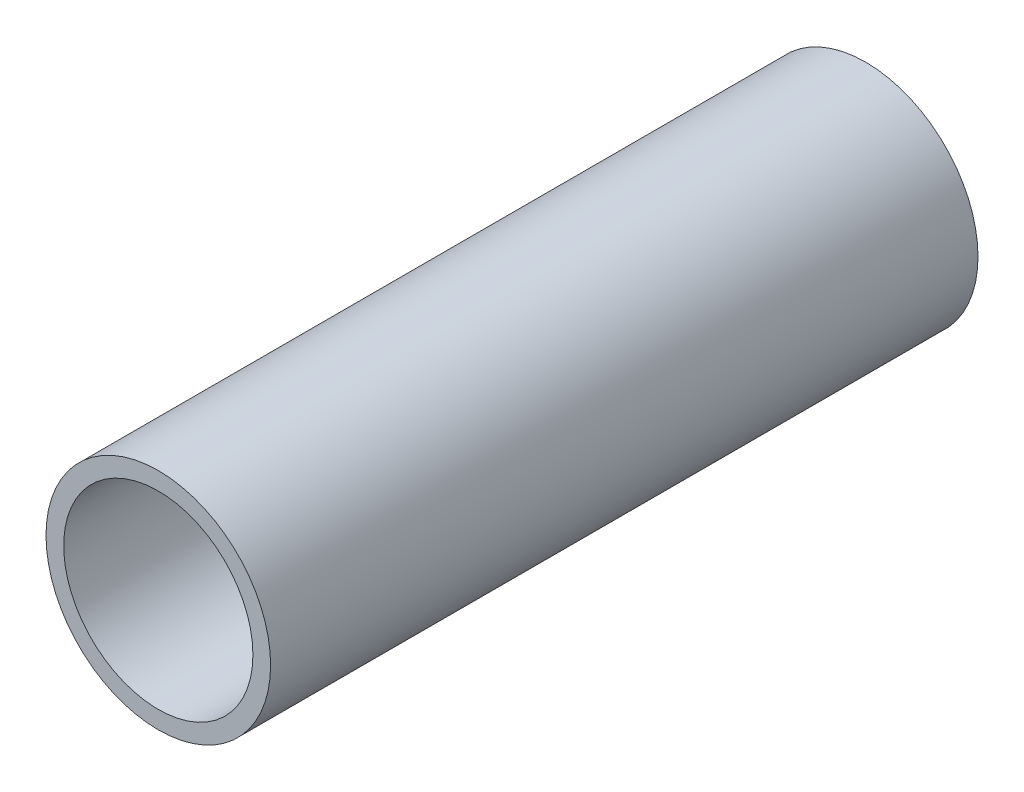
ISO-10303-21;
HEADER;
FILE_DESCRIPTION(('STEP AP214'),'2;1');
FILE_NAME('part.step','',(''),(''),'','','');
FILE_SCHEMA(('AUTOMOTIVE_DESIGN { 1 0 10303 214 1 1 1 1 }'));
ENDSEC;
DATA;
#1=APPLICATION_CONTEXT('core data for automotive mechanical design processes');
#2=APPLICATION_PROTOCOL_DEFINITION('international standard','automotive_design',2000,#1);
#3=PRODUCT_CONTEXT('',#1,'mechanical');
#4=PRODUCT('Part','Part','',(#3));
#5=PRODUCT_RELATED_PRODUCT_CATEGORY('part','',(#4));
#6=PRODUCT_DEFINITION_FORMATION('','',#4);
#7=PRODUCT_DEFINITION_CONTEXT('part definition',#1,'design');
#8=PRODUCT_DEFINITION('design','',#6,#7);
#9=PRODUCT_DEFINITION_SHAPE('','',#8);
#10=(LENGTH_UNIT() NAMED_UNIT(*) SI_UNIT(.MILLI.,.METRE.));
#11=(NAMED_UNIT(*) PLANE_ANGLE_UNIT() SI_UNIT($,.RADIAN.));
#12=(NAMED_UNIT(*) SI_UNIT($,.STERADIAN.) SOLID_ANGLE_UNIT());
#13=UNCERTAINTY_MEASURE_WITH_UNIT(LENGTH_MEASURE(1.E-05),#10,'distance_accuracy_value','');
#14=(GEOMETRIC_REPRESENTATION_CONTEXT(3) GLOBAL_UNCERTAINTY_ASSIGNED_CONTEXT((#13)) GLOBAL_UNIT_ASSIGNED_CONTEXT((#10,
#11,#12)) REPRESENTATION_CONTEXT('',''));
#15=CARTESIAN_POINT('',(0.,0.,0.));
#16=DIRECTION('',(0.,0.,1.));
#17=DIRECTION('',(1.,0.,0.));
#18=AXIS2_PLACEMENT_3D('',#15,#16,#17);
#19=CARTESIAN_POINT('',(0.,0.,-80.));
#20=DIRECTION('',(0.,0.,-1.));
#21=DIRECTION('',(1.,0.,0.));
#22=AXIS2_PLACEMENT_3D('',#19,#20,#21);
#23=PLANE('',#22);
#24=CARTESIAN_POINT('',(0.,0.,-80.));
#25=DIRECTION('',(0.,0.,1.));
#26=DIRECTION('',(1.,0.,0.));
#27=AXIS2_PLACEMENT_3D('',#24,#25,#26);
#28=CIRCLE('',#27,12.7);
#29=CARTESIAN_POINT('',(12.7,0.,-80.));
#30=VERTEX_POINT('',#29);
#31=EDGE_CURVE('E10',#30,#30,#28,.T.);
#32=ORIENTED_EDGE('',*,*,#31,.F.);
#33=EDGE_LOOP('',(#32));
#34=FACE_BOUND('',#33,.T.);
#35=CARTESIAN_POINT('',(0.,0.,-80.));
#36=DIRECTION('',(0.,0.,1.));
#37=DIRECTION('',(1.,0.,0.));
#38=AXIS2_PLACEMENT_3D('',#35,#36,#37);
#39=CIRCLE('',#38,10.7);
#40=CARTESIAN_POINT('',(10.7,0.,-80.));
#41=VERTEX_POINT('',#40);
#42=EDGE_CURVE('E46',#41,#41,#39,.T.);
#43=ORIENTED_EDGE('',*,*,#42,.T.);
#44=EDGE_LOOP('',(#43));
#45=FACE_BOUND('',#44,.T.);
#46=ADVANCED_FACE('F35',(#34,#45),#23,.T.);
#47=CARTESIAN_POINT('',(0.,0.,0.));
#48=DIRECTION('',(0.,0.,-1.));
#49=DIRECTION('',(1.,0.,0.));
#50=AXIS2_PLACEMENT_3D('',#47,#48,#49);
#51=PLANE('',#50);
#52=CARTESIAN_POINT('',(0.,0.,0.));
#53=DIRECTION('',(0.,0.,1.));
#54=DIRECTION('',(1.,0.,0.));
#55=AXIS2_PLACEMENT_3D('',#52,#53,#54);
#56=CIRCLE('',#55,12.7);
#57=CARTESIAN_POINT('',(12.7,0.,0.));
#58=VERTEX_POINT('',#57);
#59=EDGE_CURVE('E39',#58,#58,#56,.T.);
#60=ORIENTED_EDGE('',*,*,#59,.T.);
#61=EDGE_LOOP('',(#60));
#62=FACE_BOUND('',#61,.T.);
#63=CARTESIAN_POINT('',(0.,0.,0.));
#64=DIRECTION('',(0.,0.,1.));
#65=DIRECTION('',(1.,0.,0.));
#66=AXIS2_PLACEMENT_3D('',#63,#64,#65);
#67=CIRCLE('',#66,10.7);
#68=CARTESIAN_POINT('',(10.7,0.,0.));
#69=VERTEX_POINT('',#68);
#70=EDGE_CURVE('E48',#69,#69,#67,.T.);
#71=ORIENTED_EDGE('',*,*,#70,.F.);
#72=EDGE_LOOP('',(#71));
#73=FACE_BOUND('',#72,.T.);
#74=ADVANCED_FACE('F61',(#62,#73),#51,.F.);
#75=CARTESIAN_POINT('',(0.,0.,-80.));
#76=DIRECTION('',(0.,0.,1.));
#77=DIRECTION('',(-1.,0.,0.));
#78=AXIS2_PLACEMENT_3D('',#75,#76,#77);
#79=CYLINDRICAL_SURFACE('',#78,12.7);
#80=ORIENTED_EDGE('',*,*,#31,.T.);
#81=EDGE_LOOP('',(#80));
#82=FACE_BOUND('',#81,.T.);
#83=ORIENTED_EDGE('',*,*,#59,.F.);
#84=EDGE_LOOP('',(#83));
#85=FACE_BOUND('',#84,.T.);
#86=ADVANCED_FACE('F37',(#82,#85),#79,.T.);
#87=CARTESIAN_POINT('',(0.,0.,-80.));
#88=DIRECTION('',(0.,0.,1.));
#89=DIRECTION('',(-1.,0.,0.));
#90=AXIS2_PLACEMENT_3D('',#87,#88,#89);
#91=CYLINDRICAL_SURFACE('',#90,10.7);
#92=ORIENTED_EDGE('',*,*,#42,.F.);
#93=EDGE_LOOP('',(#92));
#94=FACE_BOUND('',#93,.T.);
#95=ORIENTED_EDGE('',*,*,#70,.T.);
#96=EDGE_LOOP('',(#95));
#97=FACE_BOUND('',#96,.T.);
#98=ADVANCED_FACE('F55',(#94,#97),#91,.F.);
#99=CLOSED_SHELL('',(#46,#74,#86,#98));
#100=MANIFOLD_SOLID_BREP('B2',#99);
#101=ADVANCED_BREP_SHAPE_REPRESENTATION('',(#18,#100),#14);
#102=SHAPE_DEFINITION_REPRESENTATION(#9,#101);
ENDSEC;
END-ISO-10303-21;
